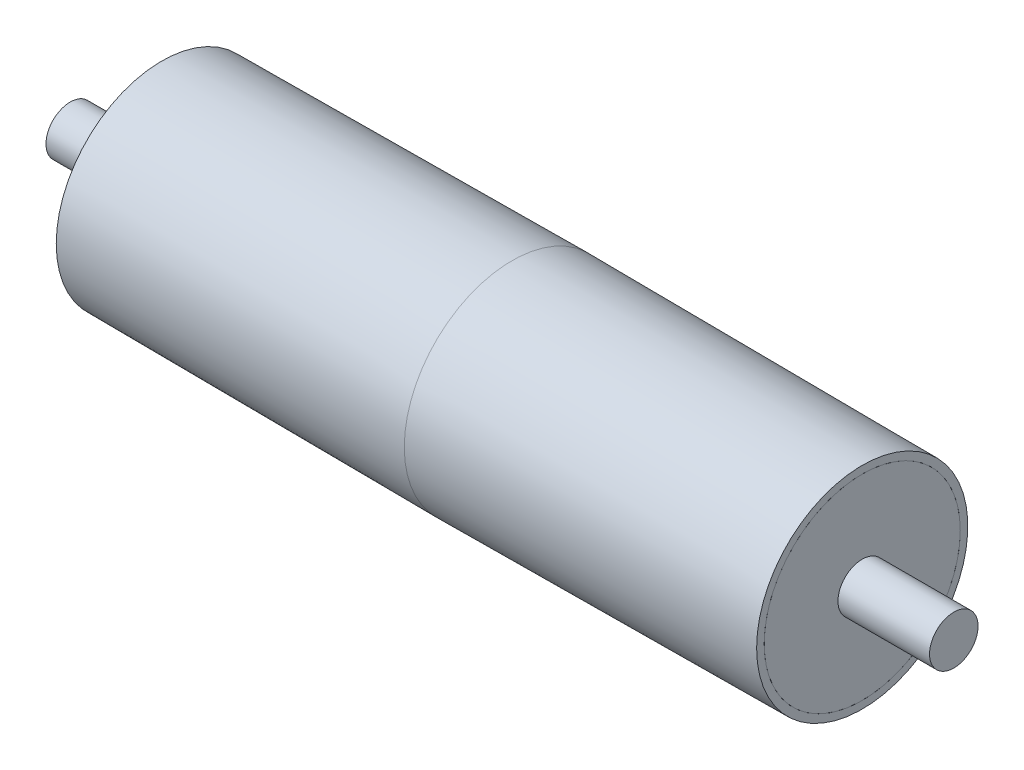
ISO-10303-21;
HEADER;
FILE_DESCRIPTION(('STEP AP214'),'2;1');
FILE_NAME('part.step','',(''),(''),'','','');
FILE_SCHEMA(('AUTOMOTIVE_DESIGN { 1 0 10303 214 1 1 1 1 }'));
ENDSEC;
DATA;
#1=APPLICATION_CONTEXT('core data for automotive mechanical design processes');
#2=APPLICATION_PROTOCOL_DEFINITION('international standard','automotive_design',2000,#1);
#3=PRODUCT_CONTEXT('',#1,'mechanical');
#4=PRODUCT('Part','Part','',(#3));
#5=PRODUCT_RELATED_PRODUCT_CATEGORY('part','',(#4));
#6=PRODUCT_DEFINITION_FORMATION('','',#4);
#7=PRODUCT_DEFINITION_CONTEXT('part definition',#1,'design');
#8=PRODUCT_DEFINITION('design','',#6,#7);
#9=PRODUCT_DEFINITION_SHAPE('','',#8);
#10=(LENGTH_UNIT() NAMED_UNIT(*) SI_UNIT(.MILLI.,.METRE.));
#11=(NAMED_UNIT(*) PLANE_ANGLE_UNIT() SI_UNIT($,.RADIAN.));
#12=(NAMED_UNIT(*) SI_UNIT($,.STERADIAN.) SOLID_ANGLE_UNIT());
#13=UNCERTAINTY_MEASURE_WITH_UNIT(LENGTH_MEASURE(1.E-05),#10,'distance_accuracy_value','');
#14=(GEOMETRIC_REPRESENTATION_CONTEXT(3) GLOBAL_UNCERTAINTY_ASSIGNED_CONTEXT((#13)) GLOBAL_UNIT_ASSIGNED_CONTEXT((#10,
#11,#12)) REPRESENTATION_CONTEXT('',''));
#15=CARTESIAN_POINT('',(0.,0.,0.));
#16=DIRECTION('',(0.,0.,1.));
#17=DIRECTION('',(1.,0.,0.));
#18=AXIS2_PLACEMENT_3D('',#15,#16,#17);
#19=CARTESIAN_POINT('',(410.,0.,0.));
#20=DIRECTION('',(-1.,0.,0.));
#21=DIRECTION('',(0.,0.,1.));
#22=AXIS2_PLACEMENT_3D('',#19,#20,#21);
#23=CYLINDRICAL_SURFACE('',#22,22.5);
#24=CARTESIAN_POINT('',(410.,0.,0.));
#25=DIRECTION('',(1.,0.,0.));
#26=DIRECTION('',(0.,0.,-1.));
#27=AXIS2_PLACEMENT_3D('',#24,#25,#26);
#28=CIRCLE('',#27,22.5);
#29=CARTESIAN_POINT('',(410.,0.,22.5));
#30=VERTEX_POINT('',#29);
#31=EDGE_CURVE('E11',#30,#30,#28,.T.);
#32=CARTESIAN_POINT('',(-410.,0.,0.));
#33=DIRECTION('',(1.,0.,0.));
#34=DIRECTION('',(0.,0.,-1.));
#35=AXIS2_PLACEMENT_3D('',#32,#33,#34);
#36=CIRCLE('',#35,22.5);
#37=CARTESIAN_POINT('',(-410.,0.,22.5));
#38=VERTEX_POINT('',#37);
#39=EDGE_CURVE('E45',#38,#38,#36,.T.);
#40=CARTESIAN_POINT('',(410.,0.,22.5));
#41=CARTESIAN_POINT('',(401.458333333333,0.,22.5));
#42=CARTESIAN_POINT('',(392.916666666667,0.,22.5));
#43=CARTESIAN_POINT('',(375.833333333333,0.,22.5));
#44=CARTESIAN_POINT('',(367.291666666667,0.,22.5));
#45=CARTESIAN_POINT('',(350.208333333333,0.,22.5));
#46=CARTESIAN_POINT('',(341.666666666667,0.,22.5));
#47=CARTESIAN_POINT('',(324.583333333333,0.,22.5));
#48=CARTESIAN_POINT('',(316.041666666667,0.,22.5));
#49=CARTESIAN_POINT('',(298.958333333333,0.,22.5));
#50=CARTESIAN_POINT('',(290.416666666667,0.,22.5));
#51=CARTESIAN_POINT('',(273.333333333333,0.,22.5));
#52=CARTESIAN_POINT('',(264.791666666667,0.,22.5));
#53=CARTESIAN_POINT('',(247.708333333333,0.,22.5));
#54=CARTESIAN_POINT('',(239.166666666667,0.,22.5));
#55=CARTESIAN_POINT('',(222.083333333333,0.,22.5));
#56=CARTESIAN_POINT('',(213.541666666667,0.,22.5));
#57=CARTESIAN_POINT('',(196.458333333333,0.,22.5));
#58=CARTESIAN_POINT('',(187.916666666667,0.,22.5));
#59=CARTESIAN_POINT('',(170.833333333333,0.,22.5));
#60=CARTESIAN_POINT('',(162.291666666667,0.,22.5));
#61=CARTESIAN_POINT('',(145.208333333333,0.,22.5));
#62=CARTESIAN_POINT('',(136.666666666667,0.,22.5));
#63=CARTESIAN_POINT('',(119.583333333333,0.,22.5));
#64=CARTESIAN_POINT('',(111.041666666667,0.,22.5));
#65=CARTESIAN_POINT('',(93.9583333333333,0.,22.5));
#66=CARTESIAN_POINT('',(85.4166666666666,0.,22.5));
#67=CARTESIAN_POINT('',(68.3333333333333,0.,22.5));
#68=CARTESIAN_POINT('',(59.7916666666666,0.,22.5));
#69=CARTESIAN_POINT('',(42.7083333333333,0.,22.5));
#70=CARTESIAN_POINT('',(34.1666666666666,0.,22.5));
#71=CARTESIAN_POINT('',(17.0833333333333,0.,22.5));
#72=CARTESIAN_POINT('',(8.54166666666661,0.,22.5));
#73=CARTESIAN_POINT('',(-8.54166666666672,0.,22.5));
#74=CARTESIAN_POINT('',(-17.0833333333334,0.,22.5));
#75=CARTESIAN_POINT('',(-34.1666666666667,0.,22.5));
#76=CARTESIAN_POINT('',(-42.7083333333334,0.,22.5));
#77=CARTESIAN_POINT('',(-59.7916666666667,0.,22.5));
#78=CARTESIAN_POINT('',(-68.3333333333334,0.,22.5));
#79=CARTESIAN_POINT('',(-85.4166666666667,0.,22.5));
#80=CARTESIAN_POINT('',(-93.9583333333334,0.,22.5));
#81=CARTESIAN_POINT('',(-111.041666666667,0.,22.5));
#82=CARTESIAN_POINT('',(-119.583333333333,0.,22.5));
#83=CARTESIAN_POINT('',(-136.666666666667,0.,22.5));
#84=CARTESIAN_POINT('',(-145.208333333333,0.,22.5));
#85=CARTESIAN_POINT('',(-162.291666666667,0.,22.5));
#86=CARTESIAN_POINT('',(-170.833333333333,0.,22.5));
#87=CARTESIAN_POINT('',(-187.916666666667,0.,22.5));
#88=CARTESIAN_POINT('',(-196.458333333333,0.,22.5));
#89=CARTESIAN_POINT('',(-213.541666666667,0.,22.5));
#90=CARTESIAN_POINT('',(-222.083333333333,0.,22.5));
#91=CARTESIAN_POINT('',(-239.166666666667,0.,22.5));
#92=CARTESIAN_POINT('',(-247.708333333333,0.,22.5));
#93=CARTESIAN_POINT('',(-264.791666666667,0.,22.5));
#94=CARTESIAN_POINT('',(-273.333333333333,0.,22.5));
#95=CARTESIAN_POINT('',(-290.416666666667,0.,22.5));
#96=CARTESIAN_POINT('',(-298.958333333333,0.,22.5));
#97=CARTESIAN_POINT('',(-316.041666666667,0.,22.5));
#98=CARTESIAN_POINT('',(-324.583333333333,0.,22.5));
#99=CARTESIAN_POINT('',(-341.666666666667,0.,22.5));
#100=CARTESIAN_POINT('',(-350.208333333333,0.,22.5));
#101=CARTESIAN_POINT('',(-367.291666666667,0.,22.5));
#102=CARTESIAN_POINT('',(-375.833333333333,0.,22.5));
#103=CARTESIAN_POINT('',(-392.916666666667,0.,22.5));
#104=CARTESIAN_POINT('',(-401.458333333333,0.,22.5));
#105=CARTESIAN_POINT('',(-410.,0.,22.5));
#106=B_SPLINE_CURVE_WITH_KNOTS('',3,(#40,#41,#42,#43,#44,#45,#46,#47,#48,#49,#50,#51,#52,#53,
#54,#55,#56,#57,#58,#59,#60,#61,#62,#63,#64,#65,#66,#67,#68,#69,#70,#71,#72,#73,#74,#75,#76,#77,
#78,#79,#80,#81,#82,#83,#84,#85,#86,#87,#88,#89,#90,#91,#92,#93,#94,#95,#96,#97,#98,#99,#100,
#101,#102,#103,#104,#105),.UNSPECIFIED.,.F.,.F.,(4,2,2,2,2,2,2,2,2,2,2,2,2,2,2,2,2,2,2,2,2,2,2,
2,2,2,2,2,2,2,2,2,4),(0.,25.625,51.25,76.875,102.5,128.125,153.75,179.375,205.,230.625,256.25,
281.875,307.5,333.125,358.75,384.375,410.,435.625,461.25,486.875,512.5,538.125,563.75,589.375,
615.,640.625,666.25,691.875,717.5,743.125,768.75,794.375,820.),.UNSPECIFIED.);
#107=EDGE_CURVE('BSEAM42',#30,#38,#106,.T.);
#108=ORIENTED_EDGE('',*,*,#31,.F.);
#109=ORIENTED_EDGE('',*,*,#39,.T.);
#110=ORIENTED_EDGE('',*,*,#107,.T.);
#111=ORIENTED_EDGE('',*,*,#107,.F.);
#112=EDGE_LOOP('',(#108,#110,#109,#111));
#113=FACE_BOUND('',#112,.T.);
#114=ADVANCED_FACE('F42',(#113),#23,.T.);
#115=CARTESIAN_POINT('',(410.,0.,0.));
#116=DIRECTION('',(1.,0.,0.));
#117=DIRECTION('',(0.,0.,-1.));
#118=AXIS2_PLACEMENT_3D('',#115,#116,#117);
#119=PLANE('',#118);
#120=ORIENTED_EDGE('',*,*,#31,.T.);
#121=EDGE_LOOP('',(#120));
#122=FACE_BOUND('',#121,.T.);
#123=ADVANCED_FACE('F57',(#122),#119,.T.);
#124=CARTESIAN_POINT('',(-410.,0.,0.));
#125=DIRECTION('',(1.,0.,0.));
#126=DIRECTION('',(0.,0.,-1.));
#127=AXIS2_PLACEMENT_3D('',#124,#125,#126);
#128=PLANE('',#127);
#129=ORIENTED_EDGE('',*,*,#39,.F.);
#130=EDGE_LOOP('',(#129));
#131=FACE_BOUND('',#130,.T.);
#132=ADVANCED_FACE('F55',(#131),#128,.F.);
#133=CLOSED_SHELL('',(#114,#123,#132));
#134=MANIFOLD_SOLID_BREP('B2',#133);
#135=CARTESIAN_POINT('',(-315.,0.,0.));
#136=DIRECTION('',(-1.,0.,0.));
#137=DIRECTION('',(0.,0.,-1.));
#138=AXIS2_PLACEMENT_3D('',#135,#136,#137);
#139=CYLINDRICAL_SURFACE('',#138,90.9998674568761);
#140=CARTESIAN_POINT('',(-315.,0.,0.));
#141=DIRECTION('',(1.,0.,0.));
#142=DIRECTION('',(0.,0.,-1.));
#143=AXIS2_PLACEMENT_3D('',#140,#141,#142);
#144=CIRCLE('',#143,90.9998674568761);
#145=CARTESIAN_POINT('',(-315.,0.,-90.9998674568761));
#146=VERTEX_POINT('',#145);
#147=EDGE_CURVE('E41',#146,#146,#144,.T.);
#148=ORIENTED_EDGE('',*,*,#147,.F.);
#149=EDGE_LOOP('',(#148));
#150=FACE_BOUND('',#149,.T.);
#151=CARTESIAN_POINT('',(-325.,0.,0.));
#152=DIRECTION('',(1.,0.,0.));
#153=DIRECTION('',(0.,0.,-1.));
#154=AXIS2_PLACEMENT_3D('',#151,#152,#153);
#155=CIRCLE('',#154,90.9998674568761);
#156=CARTESIAN_POINT('',(-325.,0.,-90.9998674568761));
#157=VERTEX_POINT('',#156);
#158=EDGE_CURVE('E98',#157,#157,#155,.T.);
#159=ORIENTED_EDGE('',*,*,#158,.T.);
#160=EDGE_LOOP('',(#159));
#161=FACE_BOUND('',#160,.T.);
#162=ADVANCED_FACE('F91',(#150,#161),#139,.T.);
#163=CARTESIAN_POINT('',(-315.,0.,0.));
#164=DIRECTION('',(-1.,0.,0.));
#165=DIRECTION('',(0.,0.,-1.));
#166=AXIS2_PLACEMENT_3D('',#163,#164,#165);
#167=PLANE('',#166);
#168=CARTESIAN_POINT('',(-315.,0.,0.));
#169=DIRECTION('',(-1.,0.,0.));
#170=DIRECTION('',(0.,0.,1.));
#171=AXIS2_PLACEMENT_3D('',#168,#169,#170);
#172=CIRCLE('',#171,22.5);
#173=CARTESIAN_POINT('',(-315.,0.,22.5));
#174=VERTEX_POINT('',#173);
#175=EDGE_CURVE('E103',#174,#174,#172,.T.);
#176=ORIENTED_EDGE('',*,*,#175,.T.);
#177=EDGE_LOOP('',(#176));
#178=FACE_BOUND('',#177,.T.);
#179=ORIENTED_EDGE('',*,*,#147,.T.);
#180=EDGE_LOOP('',(#179));
#181=FACE_BOUND('',#180,.T.);
#182=ADVANCED_FACE('F117',(#178,#181),#167,.F.);
#183=CARTESIAN_POINT('',(-325.,0.,0.));
#184=DIRECTION('',(-1.,0.,0.));
#185=DIRECTION('',(0.,0.,-1.));
#186=AXIS2_PLACEMENT_3D('',#183,#184,#185);
#187=PLANE('',#186);
#188=CARTESIAN_POINT('',(-325.,0.,0.));
#189=DIRECTION('',(-1.,0.,0.));
#190=DIRECTION('',(0.,0.,1.));
#191=AXIS2_PLACEMENT_3D('',#188,#189,#190);
#192=CIRCLE('',#191,22.5);
#193=CARTESIAN_POINT('',(-325.,0.,22.5));
#194=VERTEX_POINT('',#193);
#195=EDGE_CURVE('E94',#194,#194,#192,.T.);
#196=ORIENTED_EDGE('',*,*,#195,.F.);
#197=EDGE_LOOP('',(#196));
#198=FACE_BOUND('',#197,.T.);
#199=ORIENTED_EDGE('',*,*,#158,.F.);
#200=EDGE_LOOP('',(#199));
#201=FACE_BOUND('',#200,.T.);
#202=ADVANCED_FACE('F114',(#198,#201),#187,.T.);
#203=CARTESIAN_POINT('',(-410.,0.,0.));
#204=DIRECTION('',(1.,0.,0.));
#205=DIRECTION('',(0.,0.,-1.));
#206=AXIS2_PLACEMENT_3D('',#203,#204,#205);
#207=CYLINDRICAL_SURFACE('',#206,22.5);
#208=ORIENTED_EDGE('',*,*,#195,.T.);
#209=EDGE_LOOP('',(#208));
#210=FACE_BOUND('',#209,.T.);
#211=ORIENTED_EDGE('',*,*,#175,.F.);
#212=EDGE_LOOP('',(#211));
#213=FACE_BOUND('',#212,.T.);
#214=ADVANCED_FACE('F111',(#210,#213),#207,.F.);
#215=CLOSED_SHELL('',(#162,#182,#202,#214));
#216=MANIFOLD_SOLID_BREP('B6',#215);
#217=CARTESIAN_POINT('',(315.,0.,0.));
#218=DIRECTION('',(1.,0.,0.));
#219=DIRECTION('',(0.,0.,-1.));
#220=AXIS2_PLACEMENT_3D('',#217,#218,#219);
#221=CYLINDRICAL_SURFACE('',#220,90.9998674568761);
#222=CARTESIAN_POINT('',(315.,0.,0.));
#223=DIRECTION('',(1.,0.,0.));
#224=DIRECTION('',(0.,0.,-1.));
#225=AXIS2_PLACEMENT_3D('',#222,#223,#224);
#226=CIRCLE('',#225,90.9998674568761);
#227=CARTESIAN_POINT('',(315.,0.,-90.9998674568761));
#228=VERTEX_POINT('',#227);
#229=EDGE_CURVE('E90',#228,#228,#226,.T.);
#230=ORIENTED_EDGE('',*,*,#229,.T.);
#231=EDGE_LOOP('',(#230));
#232=FACE_BOUND('',#231,.T.);
#233=CARTESIAN_POINT('',(325.,0.,0.));
#234=DIRECTION('',(1.,0.,0.));
#235=DIRECTION('',(0.,0.,-1.));
#236=AXIS2_PLACEMENT_3D('',#233,#234,#235);
#237=CIRCLE('',#236,90.9998674568761);
#238=CARTESIAN_POINT('',(325.,0.,-90.9998674568761));
#239=VERTEX_POINT('',#238);
#240=EDGE_CURVE('E163',#239,#239,#237,.T.);
#241=ORIENTED_EDGE('',*,*,#240,.F.);
#242=EDGE_LOOP('',(#241));
#243=FACE_BOUND('',#242,.T.);
#244=ADVANCED_FACE('F160',(#232,#243),#221,.T.);
#245=CARTESIAN_POINT('',(315.,0.,0.));
#246=DIRECTION('',(1.,0.,0.));
#247=DIRECTION('',(0.,0.,-1.));
#248=AXIS2_PLACEMENT_3D('',#245,#246,#247);
#249=PLANE('',#248);
#250=CARTESIAN_POINT('',(315.,0.,0.));
#251=DIRECTION('',(1.,0.,0.));
#252=DIRECTION('',(0.,0.,-1.));
#253=AXIS2_PLACEMENT_3D('',#250,#251,#252);
#254=CIRCLE('',#253,22.5);
#255=CARTESIAN_POINT('',(315.,0.,-22.5));
#256=VERTEX_POINT('',#255);
#257=EDGE_CURVE('E170',#256,#256,#254,.T.);
#258=ORIENTED_EDGE('',*,*,#257,.T.);
#259=EDGE_LOOP('',(#258));
#260=FACE_BOUND('',#259,.T.);
#261=ORIENTED_EDGE('',*,*,#229,.F.);
#262=EDGE_LOOP('',(#261));
#263=FACE_BOUND('',#262,.T.);
#264=ADVANCED_FACE('F184',(#260,#263),#249,.F.);
#265=CARTESIAN_POINT('',(325.,0.,0.));
#266=DIRECTION('',(1.,0.,0.));
#267=DIRECTION('',(0.,0.,-1.));
#268=AXIS2_PLACEMENT_3D('',#265,#266,#267);
#269=PLANE('',#268);
#270=CARTESIAN_POINT('',(325.,0.,0.));
#271=DIRECTION('',(1.,0.,0.));
#272=DIRECTION('',(0.,0.,-1.));
#273=AXIS2_PLACEMENT_3D('',#270,#271,#272);
#274=CIRCLE('',#273,22.5);
#275=CARTESIAN_POINT('',(325.,0.,-22.5));
#276=VERTEX_POINT('',#275);
#277=EDGE_CURVE('E174',#276,#276,#274,.T.);
#278=ORIENTED_EDGE('',*,*,#277,.F.);
#279=EDGE_LOOP('',(#278));
#280=FACE_BOUND('',#279,.T.);
#281=ORIENTED_EDGE('',*,*,#240,.T.);
#282=EDGE_LOOP('',(#281));
#283=FACE_BOUND('',#282,.T.);
#284=ADVANCED_FACE('F181',(#280,#283),#269,.T.);
#285=CARTESIAN_POINT('',(-410.,0.,0.));
#286=DIRECTION('',(1.,0.,0.));
#287=DIRECTION('',(0.,0.,-1.));
#288=AXIS2_PLACEMENT_3D('',#285,#286,#287);
#289=CYLINDRICAL_SURFACE('',#288,22.5);
#290=ORIENTED_EDGE('',*,*,#277,.T.);
#291=EDGE_LOOP('',(#290));
#292=FACE_BOUND('',#291,.T.);
#293=ORIENTED_EDGE('',*,*,#257,.F.);
#294=EDGE_LOOP('',(#293));
#295=FACE_BOUND('',#294,.T.);
#296=ADVANCED_FACE('F178',(#292,#295),#289,.F.);
#297=CLOSED_SHELL('',(#244,#264,#284,#296));
#298=MANIFOLD_SOLID_BREP('B36',#297);
#299=CARTESIAN_POINT('',(-325.,98.,0.));
#300=DIRECTION('',(1.,0.,0.));
#301=DIRECTION('',(0.,0.,-1.));
#302=AXIS2_PLACEMENT_3D('',#299,#300,#301);
#303=PLANE('',#302);
#304=CARTESIAN_POINT('',(-325.,0.,0.));
#305=DIRECTION('',(1.,0.,0.));
#306=DIRECTION('',(0.,0.,-1.));
#307=AXIS2_PLACEMENT_3D('',#304,#305,#306);
#308=CIRCLE('',#307,90.9998674568761);
#309=CARTESIAN_POINT('',(-325.,0.,-90.9998674568761));
#310=VERTEX_POINT('',#309);
#311=EDGE_CURVE('E239',#310,#310,#308,.F.);
#312=ORIENTED_EDGE('',*,*,#311,.F.);
#313=EDGE_LOOP('',(#312));
#314=FACE_BOUND('',#313,.T.);
#315=CARTESIAN_POINT('',(-325.,0.,0.));
#316=DIRECTION('',(-1.,0.,0.));
#317=DIRECTION('',(0.,0.,1.));
#318=AXIS2_PLACEMENT_3D('',#315,#316,#317);
#319=CIRCLE('',#318,98.);
#320=CARTESIAN_POINT('',(-325.,0.,98.));
#321=VERTEX_POINT('',#320);
#322=EDGE_CURVE('E232',#321,#321,#319,.T.);
#323=ORIENTED_EDGE('',*,*,#322,.T.);
#324=EDGE_LOOP('',(#323));
#325=FACE_BOUND('',#324,.T.);
#326=ADVANCED_FACE('F222',(#314,#325),#303,.F.);
#327=CARTESIAN_POINT('',(325.,0.,0.));
#328=DIRECTION('',(-1.,0.,0.));
#329=DIRECTION('',(0.,0.,1.));
#330=AXIS2_PLACEMENT_3D('',#327,#328,#329);
#331=PLANE('',#330);
#332=CARTESIAN_POINT('',(325.,0.,0.));
#333=DIRECTION('',(-1.,0.,0.));
#334=DIRECTION('',(0.,0.,1.));
#335=AXIS2_PLACEMENT_3D('',#332,#333,#334);
#336=CIRCLE('',#335,90.9998674568761);
#337=CARTESIAN_POINT('',(325.,0.,90.9998674568761));
#338=VERTEX_POINT('',#337);
#339=EDGE_CURVE('E236',#338,#338,#336,.T.);
#340=ORIENTED_EDGE('',*,*,#339,.T.);
#341=EDGE_LOOP('',(#340));
#342=FACE_BOUND('',#341,.T.);
#343=CARTESIAN_POINT('',(325.,0.,0.));
#344=DIRECTION('',(-1.,0.,0.));
#345=DIRECTION('',(0.,0.,1.));
#346=AXIS2_PLACEMENT_3D('',#343,#344,#345);
#347=CIRCLE('',#346,98.);
#348=CARTESIAN_POINT('',(325.,0.,98.));
#349=VERTEX_POINT('',#348);
#350=EDGE_CURVE('E159',#349,#349,#347,.T.);
#351=ORIENTED_EDGE('',*,*,#350,.F.);
#352=EDGE_LOOP('',(#351));
#353=FACE_BOUND('',#352,.T.);
#354=ADVANCED_FACE('F262',(#342,#353),#331,.F.);
#355=CARTESIAN_POINT('',(325.,0.,0.));
#356=DIRECTION('',(-1.,0.,0.));
#357=DIRECTION('',(0.,0.,1.));
#358=AXIS2_PLACEMENT_3D('',#355,#356,#357);
#359=CONICAL_SURFACE('',#358,98.,0.00615376847392404);
#360=CARTESIAN_POINT('',(0.,0.,0.));
#361=DIRECTION('',(-1.,0.,0.));
#362=DIRECTION('',(0.,0.,1.));
#363=AXIS2_PLACEMENT_3D('',#360,#361,#362);
#364=CIRCLE('',#363,100.);
#365=CARTESIAN_POINT('',(0.,0.,100.));
#366=VERTEX_POINT('',#365);
#367=EDGE_CURVE('E228',#366,#366,#364,.T.);
#368=ORIENTED_EDGE('',*,*,#367,.F.);
#369=EDGE_LOOP('',(#368));
#370=FACE_BOUND('',#369,.T.);
#371=ORIENTED_EDGE('',*,*,#350,.T.);
#372=EDGE_LOOP('',(#371));
#373=FACE_BOUND('',#372,.T.);
#374=ADVANCED_FACE('F267',(#370,#373),#359,.T.);
#375=CARTESIAN_POINT('',(0.,0.,0.));
#376=DIRECTION('',(1.,0.,0.));
#377=DIRECTION('',(0.,0.,-1.));
#378=AXIS2_PLACEMENT_3D('',#375,#376,#377);
#379=CONICAL_SURFACE('',#378,100.,0.00615376847392404);
#380=ORIENTED_EDGE('',*,*,#322,.F.);
#381=EDGE_LOOP('',(#380));
#382=FACE_BOUND('',#381,.T.);
#383=ORIENTED_EDGE('',*,*,#367,.T.);
#384=EDGE_LOOP('',(#383));
#385=FACE_BOUND('',#384,.T.);
#386=ADVANCED_FACE('F258',(#382,#385),#379,.T.);
#387=CARTESIAN_POINT('',(324.956923892558,0.,0.));
#388=DIRECTION('',(-1.,0.,0.));
#389=DIRECTION('',(0.,0.,1.));
#390=AXIS2_PLACEMENT_3D('',#387,#388,#389);
#391=CONICAL_SURFACE('',#390,91.0001325406142,0.00615376847392404);
#392=CARTESIAN_POINT('',(-3.5527136788005E-12,0.,0.));
#393=DIRECTION('',(-1.,0.,0.));
#394=DIRECTION('',(0.,0.,1.));
#395=AXIS2_PLACEMENT_3D('',#392,#393,#394);
#396=CIRCLE('',#395,92.9998674568761);
#397=CARTESIAN_POINT('',(-3.5527136788005E-12,0.,92.9998674568761));
#398=VERTEX_POINT('',#397);
#399=EDGE_CURVE('E242',#398,#398,#396,.T.);
#400=ORIENTED_EDGE('',*,*,#399,.T.);
#401=EDGE_LOOP('',(#400));
#402=FACE_BOUND('',#401,.T.);
#403=ORIENTED_EDGE('',*,*,#339,.F.);
#404=EDGE_LOOP('',(#403));
#405=FACE_BOUND('',#404,.T.);
#406=ADVANCED_FACE('F248',(#402,#405),#391,.F.);
#407=CARTESIAN_POINT('',(0.0430761074423739,0.,0.));
#408=DIRECTION('',(1.,0.,0.));
#409=DIRECTION('',(0.,0.,-1.));
#410=AXIS2_PLACEMENT_3D('',#407,#408,#409);
#411=CONICAL_SURFACE('',#410,93.0001325406142,0.00615376847392404);
#412=ORIENTED_EDGE('',*,*,#311,.T.);
#413=EDGE_LOOP('',(#412));
#414=FACE_BOUND('',#413,.T.);
#415=ORIENTED_EDGE('',*,*,#399,.F.);
#416=EDGE_LOOP('',(#415));
#417=FACE_BOUND('',#416,.T.);
#418=ADVANCED_FACE('F251',(#414,#417),#411,.F.);
#419=CLOSED_SHELL('',(#326,#354,#374,#386,#406,#418));
#420=MANIFOLD_SOLID_BREP('B85',#419);
#421=ADVANCED_BREP_SHAPE_REPRESENTATION('',(#18,#134,#216,#298,#420),#14);
#422=SHAPE_DEFINITION_REPRESENTATION(#9,#421);
ENDSEC;
END-ISO-10303-21;
